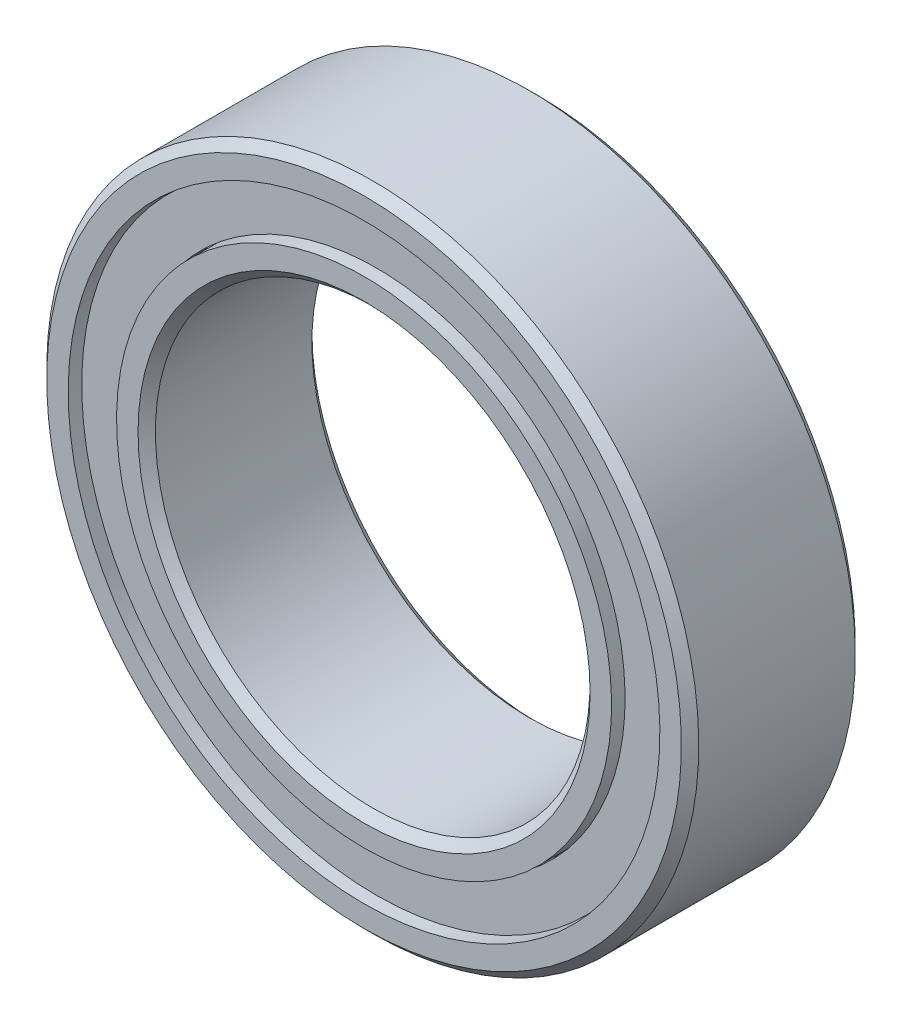
ISO-10303-21;
HEADER;
FILE_DESCRIPTION(('STEP AP214'),'2;1');
FILE_NAME('part.step','',(''),(''),'','','');
FILE_SCHEMA(('AUTOMOTIVE_DESIGN { 1 0 10303 214 1 1 1 1 }'));
ENDSEC;
DATA;
#1=APPLICATION_CONTEXT('core data for automotive mechanical design processes');
#2=APPLICATION_PROTOCOL_DEFINITION('international standard','automotive_design',2000,#1);
#3=PRODUCT_CONTEXT('',#1,'mechanical');
#4=PRODUCT('Part','Part','',(#3));
#5=PRODUCT_RELATED_PRODUCT_CATEGORY('part','',(#4));
#6=PRODUCT_DEFINITION_FORMATION('','',#4);
#7=PRODUCT_DEFINITION_CONTEXT('part definition',#1,'design');
#8=PRODUCT_DEFINITION('design','',#6,#7);
#9=PRODUCT_DEFINITION_SHAPE('','',#8);
#10=(LENGTH_UNIT() NAMED_UNIT(*) SI_UNIT(.MILLI.,.METRE.));
#11=(NAMED_UNIT(*) PLANE_ANGLE_UNIT() SI_UNIT($,.RADIAN.));
#12=(NAMED_UNIT(*) SI_UNIT($,.STERADIAN.) SOLID_ANGLE_UNIT());
#13=UNCERTAINTY_MEASURE_WITH_UNIT(LENGTH_MEASURE(1.E-05),#10,'distance_accuracy_value','');
#14=(GEOMETRIC_REPRESENTATION_CONTEXT(3) GLOBAL_UNCERTAINTY_ASSIGNED_CONTEXT((#13)) GLOBAL_UNIT_ASSIGNED_CONTEXT((#10,
#11,#12)) REPRESENTATION_CONTEXT('',''));
#15=CARTESIAN_POINT('',(0.,0.,0.));
#16=DIRECTION('',(0.,0.,1.));
#17=DIRECTION('',(1.,0.,0.));
#18=AXIS2_PLACEMENT_3D('',#15,#16,#17);
#19=CARTESIAN_POINT('',(3.37900510909742,5.25783458019492,0.));
#20=DIRECTION('',(0.,0.,1.));
#21=DIRECTION('',(0.540640817455587,0.841253532831188,0.));
#22=AXIS2_PLACEMENT_3D('',#19,#20,#21);
#23=SPHERICAL_SURFACE('',#22,1.04822012578407);
#24=CARTESIAN_POINT('',(3.37900510909742,5.25783458019492,1.04822012578406));
#25=VERTEX_POINT('',#24);
#26=VERTEX_LOOP('',#25);
#27=FACE_BOUND('',#26,.T.);
#28=ADVANCED_FACE('F37',(#27),#23,.T.);
#29=CLOSED_SHELL('',(#28));
#30=MANIFOLD_SOLID_BREP('B2',#29);
#31=CARTESIAN_POINT('',(5.68519997096571,2.59634383126185,0.));
#32=DIRECTION('',(0.,0.,1.));
#33=DIRECTION('',(0.909631995354514,0.415415013001897,0.));
#34=AXIS2_PLACEMENT_3D('',#31,#32,#33);
#35=SPHERICAL_SURFACE('',#34,1.04822012578407);
#36=CARTESIAN_POINT('',(5.68519997096571,2.59634383126185,1.04822012578406));
#37=VERTEX_POINT('',#36);
#38=VERTEX_LOOP('',#37);
#39=FACE_BOUND('',#38,.T.);
#40=ADVANCED_FACE('F57',(#39),#35,.T.);
#41=CLOSED_SHELL('',(#40));
#42=MANIFOLD_SOLID_BREP('B6',#41);
#43=CARTESIAN_POINT('',(6.18638401175584,-0.889467739207972,0.));
#44=DIRECTION('',(0.,0.,1.));
#45=DIRECTION('',(0.989821441880934,-0.142314838273276,0.));
#46=AXIS2_PLACEMENT_3D('',#43,#44,#45);
#47=SPHERICAL_SURFACE('',#46,1.04822012578407);
#48=CARTESIAN_POINT('',(6.18638401175584,-0.889467739207972,1.04822012578406));
#49=VERTEX_POINT('',#48);
#50=VERTEX_LOOP('',#49);
#51=FACE_BOUND('',#50,.T.);
#52=ADVANCED_FACE('F77',(#51),#47,.T.);
#53=CLOSED_SHELL('',(#52));
#54=MANIFOLD_SOLID_BREP('B33',#53);
#55=CARTESIAN_POINT('',(4.72343483971415,-4.09287958715799,0.));
#56=DIRECTION('',(0.,0.,1.));
#57=DIRECTION('',(0.755749574354264,-0.654860733945279,0.));
#58=AXIS2_PLACEMENT_3D('',#55,#56,#57);
#59=SPHERICAL_SURFACE('',#58,1.04822012578407);
#60=CARTESIAN_POINT('',(4.72343483971415,-4.09287958715799,1.04822012578406));
#61=VERTEX_POINT('',#60);
#62=VERTEX_LOOP('',#61);
#63=FACE_BOUND('',#62,.T.);
#64=ADVANCED_FACE('F97',(#63),#59,.T.);
#65=CLOSED_SHELL('',(#64));
#66=MANIFOLD_SOLID_BREP('B53',#65);
#67=CARTESIAN_POINT('',(1.76082848025898,-5.99683108509059,0.));
#68=DIRECTION('',(0.,0.,1.));
#69=DIRECTION('',(0.281732556841437,-0.959492973614495,0.));
#70=AXIS2_PLACEMENT_3D('',#67,#68,#69);
#71=SPHERICAL_SURFACE('',#70,1.04822012578407);
#72=CARTESIAN_POINT('',(1.76082848025898,-5.99683108509059,1.04822012578406));
#73=VERTEX_POINT('',#72);
#74=VERTEX_LOOP('',#73);
#75=FACE_BOUND('',#74,.T.);
#76=ADVANCED_FACE('F117',(#75),#71,.T.);
#77=CLOSED_SHELL('',(#76));
#78=MANIFOLD_SOLID_BREP('B73',#77);
#79=CARTESIAN_POINT('',(-1.7608284802589,-5.99683108509062,0.));
#80=DIRECTION('',(0.,0.,1.));
#81=DIRECTION('',(-0.281732556841424,-0.959492973614499,0.));
#82=AXIS2_PLACEMENT_3D('',#79,#80,#81);
#83=SPHERICAL_SURFACE('',#82,1.04822012578407);
#84=CARTESIAN_POINT('',(-1.7608284802589,-5.99683108509062,1.04822012578406));
#85=VERTEX_POINT('',#84);
#86=VERTEX_LOOP('',#85);
#87=FACE_BOUND('',#86,.T.);
#88=ADVANCED_FACE('F137',(#87),#83,.T.);
#89=CLOSED_SHELL('',(#88));
#90=MANIFOLD_SOLID_BREP('B93',#89);
#91=CARTESIAN_POINT('',(-4.72343483971409,-4.09287958715805,0.));
#92=DIRECTION('',(0.,0.,1.));
#93=DIRECTION('',(-0.755749574354255,-0.654860733945289,0.));
#94=AXIS2_PLACEMENT_3D('',#91,#92,#93);
#95=SPHERICAL_SURFACE('',#94,1.04822012578407);
#96=CARTESIAN_POINT('',(-4.72343483971409,-4.09287958715805,1.04822012578406));
#97=VERTEX_POINT('',#96);
#98=VERTEX_LOOP('',#97);
#99=FACE_BOUND('',#98,.T.);
#100=ADVANCED_FACE('F157',(#99),#95,.T.);
#101=CLOSED_SHELL('',(#100));
#102=MANIFOLD_SOLID_BREP('B113',#101);
#103=CARTESIAN_POINT('',(-6.18638401175583,-0.889467739208054,0.));
#104=DIRECTION('',(0.,0.,1.));
#105=DIRECTION('',(-0.989821441880932,-0.142314838273289,0.));
#106=AXIS2_PLACEMENT_3D('',#103,#104,#105);
#107=SPHERICAL_SURFACE('',#106,1.04822012578407);
#108=CARTESIAN_POINT('',(-6.18638401175583,-0.889467739208054,1.04822012578406));
#109=VERTEX_POINT('',#108);
#110=VERTEX_LOOP('',#109);
#111=FACE_BOUND('',#110,.T.);
#112=ADVANCED_FACE('F177',(#111),#107,.T.);
#113=CLOSED_SHELL('',(#112));
#114=MANIFOLD_SOLID_BREP('B133',#113);
#115=CARTESIAN_POINT('',(-5.68519997096575,2.59634383126178,0.));
#116=DIRECTION('',(0.,0.,1.));
#117=DIRECTION('',(-0.90963199535452,0.415415013001884,0.));
#118=AXIS2_PLACEMENT_3D('',#115,#116,#117);
#119=SPHERICAL_SURFACE('',#118,1.04822012578407);
#120=CARTESIAN_POINT('',(-5.68519997096575,2.59634383126178,1.04822012578406));
#121=VERTEX_POINT('',#120);
#122=VERTEX_LOOP('',#121);
#123=FACE_BOUND('',#122,.T.);
#124=ADVANCED_FACE('F197',(#123),#119,.T.);
#125=CLOSED_SHELL('',(#124));
#126=MANIFOLD_SOLID_BREP('B153',#125);
#127=CARTESIAN_POINT('',(-3.37900510909749,5.25783458019488,0.));
#128=DIRECTION('',(0.,0.,1.));
#129=DIRECTION('',(-0.540640817455599,0.841253532831181,0.));
#130=AXIS2_PLACEMENT_3D('',#127,#128,#129);
#131=SPHERICAL_SURFACE('',#130,1.04822012578407);
#132=CARTESIAN_POINT('',(-3.37900510909749,5.25783458019488,1.04822012578406));
#133=VERTEX_POINT('',#132);
#134=VERTEX_LOOP('',#133);
#135=FACE_BOUND('',#134,.T.);
#136=ADVANCED_FACE('F217',(#135),#131,.T.);
#137=CLOSED_SHELL('',(#136));
#138=MANIFOLD_SOLID_BREP('B173',#137);
#139=CARTESIAN_POINT('',(0.,6.25,0.));
#140=DIRECTION('',(0.,0.,1.));
#141=DIRECTION('',(0.,1.,0.));
#142=AXIS2_PLACEMENT_3D('',#139,#140,#141);
#143=SPHERICAL_SURFACE('',#142,1.04822012578407);
#144=CARTESIAN_POINT('',(0.,6.25,1.04822012578406));
#145=VERTEX_POINT('',#144);
#146=VERTEX_LOOP('',#145);
#147=FACE_BOUND('',#146,.T.);
#148=ADVANCED_FACE('F239',(#147),#143,.T.);
#149=CLOSED_SHELL('',(#148));
#150=MANIFOLD_SOLID_BREP('B193',#149);
#151=CARTESIAN_POINT('',(0.,5.69444444444443,2.00000000000003));
#152=DIRECTION('',(0.,0.,-1.));
#153=DIRECTION('',(0.,1.,0.));
#154=AXIS2_PLACEMENT_3D('',#151,#152,#153);
#155=PLANE('',#154);
#156=CARTESIAN_POINT('',(0.,0.,2.00000000000003));
#157=DIRECTION('',(0.,0.,1.));
#158=DIRECTION('',(0.,-1.,0.));
#159=AXIS2_PLACEMENT_3D('',#156,#157,#158);
#160=CIRCLE('',#159,5.19999999999999);
#161=CARTESIAN_POINT('',(0.,-5.19999999999999,2.00000000000003));
#162=VERTEX_POINT('',#161);
#163=EDGE_CURVE('E287',#162,#162,#160,.T.);
#164=ORIENTED_EDGE('',*,*,#163,.F.);
#165=EDGE_LOOP('',(#164));
#166=FACE_BOUND('',#165,.T.);
#167=CARTESIAN_POINT('',(0.,0.,2.00000000000003));
#168=DIRECTION('',(0.,0.,1.));
#169=DIRECTION('',(0.,-1.,0.));
#170=AXIS2_PLACEMENT_3D('',#167,#168,#169);
#171=CIRCLE('',#170,5.69444444444443);
#172=CARTESIAN_POINT('',(0.,-5.69444444444443,2.00000000000003));
#173=VERTEX_POINT('',#172);
#174=EDGE_CURVE('E238',#173,#173,#171,.T.);
#175=ORIENTED_EDGE('',*,*,#174,.T.);
#176=EDGE_LOOP('',(#175));
#177=FACE_BOUND('',#176,.T.);
#178=ADVANCED_FACE('F259',(#166,#177),#155,.F.);
#179=CARTESIAN_POINT('',(0.,0.,2.00000000000002));
#180=DIRECTION('',(0.,0.,1.));
#181=DIRECTION('',(0.,-1.,0.));
#182=AXIS2_PLACEMENT_3D('',#179,#180,#181);
#183=CYLINDRICAL_SURFACE('',#182,5.69444444444443);
#184=ORIENTED_EDGE('',*,*,#174,.F.);
#185=EDGE_LOOP('',(#184));
#186=FACE_BOUND('',#185,.T.);
#187=CARTESIAN_POINT('',(0.,0.,0.888888888888882));
#188=DIRECTION('',(0.,0.,1.));
#189=DIRECTION('',(0.,-1.,0.));
#190=AXIS2_PLACEMENT_3D('',#187,#188,#189);
#191=CIRCLE('',#190,5.69444444444443);
#192=CARTESIAN_POINT('',(0.,-5.69444444444443,0.888888888888882));
#193=VERTEX_POINT('',#192);
#194=EDGE_CURVE('E265',#193,#193,#191,.T.);
#195=ORIENTED_EDGE('',*,*,#194,.T.);
#196=EDGE_LOOP('',(#195));
#197=FACE_BOUND('',#196,.T.);
#198=ADVANCED_FACE('F294',(#186,#197),#183,.T.);
#199=CARTESIAN_POINT('',(0.,0.,0.));
#200=DIRECTION('',(0.,0.,1.));
#201=DIRECTION('',(0.,-1.,0.));
#202=AXIS2_PLACEMENT_3D('',#199,#200,#201);
#203=TOROIDAL_SURFACE('',#202,6.24999999999999,1.04822012578407);
#204=ORIENTED_EDGE('',*,*,#194,.F.);
#205=EDGE_LOOP('',(#204));
#206=FACE_BOUND('',#205,.T.);
#207=CARTESIAN_POINT('',(0.,0.,-0.888888888888884));
#208=DIRECTION('',(0.,0.,1.));
#209=DIRECTION('',(0.,-1.,0.));
#210=AXIS2_PLACEMENT_3D('',#207,#208,#209);
#211=CIRCLE('',#210,5.69444444444443);
#212=CARTESIAN_POINT('',(0.,-5.69444444444443,-0.888888888888885));
#213=VERTEX_POINT('',#212);
#214=EDGE_CURVE('E269',#213,#213,#211,.T.);
#215=ORIENTED_EDGE('',*,*,#214,.T.);
#216=EDGE_LOOP('',(#215));
#217=FACE_BOUND('',#216,.T.);
#218=ADVANCED_FACE('F298',(#206,#217),#203,.F.);
#219=CARTESIAN_POINT('',(0.,0.,2.00000000000002));
#220=DIRECTION('',(0.,0.,1.));
#221=DIRECTION('',(0.,-1.,0.));
#222=AXIS2_PLACEMENT_3D('',#219,#220,#221);
#223=CYLINDRICAL_SURFACE('',#222,5.69444444444443);
#224=ORIENTED_EDGE('',*,*,#214,.F.);
#225=EDGE_LOOP('',(#224));
#226=FACE_BOUND('',#225,.T.);
#227=CARTESIAN_POINT('',(0.,0.,-2.00000000000003));
#228=DIRECTION('',(0.,0.,1.));
#229=DIRECTION('',(0.,-1.,0.));
#230=AXIS2_PLACEMENT_3D('',#227,#228,#229);
#231=CIRCLE('',#230,5.69444444444443);
#232=CARTESIAN_POINT('',(0.,-5.69444444444442,-2.00000000000003));
#233=VERTEX_POINT('',#232);
#234=EDGE_CURVE('E273',#233,#233,#231,.T.);
#235=ORIENTED_EDGE('',*,*,#234,.T.);
#236=EDGE_LOOP('',(#235));
#237=FACE_BOUND('',#236,.T.);
#238=ADVANCED_FACE('F303',(#226,#237),#223,.T.);
#239=CARTESIAN_POINT('',(0.,5.2,-2.00000000000003));
#240=DIRECTION('',(0.,0.,1.));
#241=DIRECTION('',(0.,-1.,0.));
#242=AXIS2_PLACEMENT_3D('',#239,#240,#241);
#243=PLANE('',#242);
#244=ORIENTED_EDGE('',*,*,#234,.F.);
#245=EDGE_LOOP('',(#244));
#246=FACE_BOUND('',#245,.T.);
#247=CARTESIAN_POINT('',(0.,0.,-2.00000000000003));
#248=DIRECTION('',(0.,0.,1.));
#249=DIRECTION('',(0.,-1.,0.));
#250=AXIS2_PLACEMENT_3D('',#247,#248,#249);
#251=CIRCLE('',#250,5.2);
#252=CARTESIAN_POINT('',(0.,-5.2,-2.00000000000004));
#253=VERTEX_POINT('',#252);
#254=EDGE_CURVE('E278',#253,#253,#251,.T.);
#255=ORIENTED_EDGE('',*,*,#254,.T.);
#256=EDGE_LOOP('',(#255));
#257=FACE_BOUND('',#256,.T.);
#258=ADVANCED_FACE('F309',(#246,#257),#243,.F.);
#259=CARTESIAN_POINT('',(0.,0.,-1.80000000000003));
#260=DIRECTION('',(0.,0.,-1.));
#261=DIRECTION('',(0.,1.,0.));
#262=AXIS2_PLACEMENT_3D('',#259,#260,#261);
#263=CONICAL_SURFACE('',#262,4.99999999999999,0.785398163397475);
#264=ORIENTED_EDGE('',*,*,#254,.F.);
#265=EDGE_LOOP('',(#264));
#266=FACE_BOUND('',#265,.T.);
#267=CARTESIAN_POINT('',(0.,0.,-1.80000000000003));
#268=DIRECTION('',(0.,0.,1.));
#269=DIRECTION('',(0.,-1.,0.));
#270=AXIS2_PLACEMENT_3D('',#267,#268,#269);
#271=CIRCLE('',#270,4.99999999999999);
#272=CARTESIAN_POINT('',(0.,-4.99999999999999,-1.80000000000003));
#273=VERTEX_POINT('',#272);
#274=EDGE_CURVE('E281',#273,#273,#271,.T.);
#275=ORIENTED_EDGE('',*,*,#274,.T.);
#276=EDGE_LOOP('',(#275));
#277=FACE_BOUND('',#276,.T.);
#278=ADVANCED_FACE('F313',(#266,#277),#263,.F.);
#279=CARTESIAN_POINT('',(0.,0.,2.00000000000002));
#280=DIRECTION('',(0.,0.,1.));
#281=DIRECTION('',(0.,-1.,0.));
#282=AXIS2_PLACEMENT_3D('',#279,#280,#281);
#283=CYLINDRICAL_SURFACE('',#282,4.99999999999999);
#284=ORIENTED_EDGE('',*,*,#274,.F.);
#285=EDGE_LOOP('',(#284));
#286=FACE_BOUND('',#285,.T.);
#287=CARTESIAN_POINT('',(0.,0.,1.80000000000002));
#288=DIRECTION('',(0.,0.,1.));
#289=DIRECTION('',(0.,-1.,0.));
#290=AXIS2_PLACEMENT_3D('',#287,#288,#289);
#291=CIRCLE('',#290,5.);
#292=CARTESIAN_POINT('',(0.,-5.,1.80000000000001));
#293=VERTEX_POINT('',#292);
#294=EDGE_CURVE('E284',#293,#293,#291,.T.);
#295=ORIENTED_EDGE('',*,*,#294,.T.);
#296=EDGE_LOOP('',(#295));
#297=FACE_BOUND('',#296,.T.);
#298=ADVANCED_FACE('F317',(#286,#297),#283,.F.);
#299=CARTESIAN_POINT('',(0.,0.,2.00000000000003));
#300=DIRECTION('',(0.,0.,1.));
#301=DIRECTION('',(0.,-1.,0.));
#302=AXIS2_PLACEMENT_3D('',#299,#300,#301);
#303=CONICAL_SURFACE('',#302,5.19999999999999,0.785398163397398);
#304=ORIENTED_EDGE('',*,*,#294,.F.);
#305=EDGE_LOOP('',(#304));
#306=FACE_BOUND('',#305,.T.);
#307=ORIENTED_EDGE('',*,*,#163,.T.);
#308=EDGE_LOOP('',(#307));
#309=FACE_BOUND('',#308,.T.);
#310=ADVANCED_FACE('F291',(#306,#309),#303,.F.);
#311=CLOSED_SHELL('',(#178,#198,#218,#238,#258,#278,#298,#310));
#312=MANIFOLD_SOLID_BREP('B213',#311);
#313=CARTESIAN_POINT('',(0.,5.71984444444445,-1.33361006289205));
#314=DIRECTION('',(0.,0.,-1.));
#315=DIRECTION('',(0.,1.,0.));
#316=AXIS2_PLACEMENT_3D('',#313,#314,#315);
#317=PLANE('',#316);
#318=CARTESIAN_POINT('',(0.,0.,-1.33361006289205));
#319=DIRECTION('',(0.,0.,1.));
#320=DIRECTION('',(0.,-1.,0.));
#321=AXIS2_PLACEMENT_3D('',#318,#319,#320);
#322=CIRCLE('',#321,5.71984444444445);
#323=CARTESIAN_POINT('',(0.,-5.71984444444445,-1.33361006289205));
#324=VERTEX_POINT('',#323);
#325=EDGE_CURVE('E402',#324,#324,#322,.T.);
#326=ORIENTED_EDGE('',*,*,#325,.F.);
#327=EDGE_LOOP('',(#326));
#328=FACE_BOUND('',#327,.T.);
#329=CARTESIAN_POINT('',(0.,0.,-1.33361006289205));
#330=DIRECTION('',(0.,0.,1.));
#331=DIRECTION('',(0.,-1.,0.));
#332=AXIS2_PLACEMENT_3D('',#329,#330,#331);
#333=CIRCLE('',#332,6.78015555555556);
#334=CARTESIAN_POINT('',(0.,-6.78015555555556,-1.33361006289205));
#335=VERTEX_POINT('',#334);
#336=EDGE_CURVE('E258',#335,#335,#333,.T.);
#337=ORIENTED_EDGE('',*,*,#336,.T.);
#338=EDGE_LOOP('',(#337));
#339=FACE_BOUND('',#338,.T.);
#340=ADVANCED_FACE('F388',(#328,#339),#317,.F.);
#341=CARTESIAN_POINT('',(0.,0.,2.00000000000002));
#342=DIRECTION('',(0.,0.,1.));
#343=DIRECTION('',(0.,-1.,0.));
#344=AXIS2_PLACEMENT_3D('',#341,#342,#343);
#345=CYLINDRICAL_SURFACE('',#344,6.78015555555556);
#346=ORIENTED_EDGE('',*,*,#336,.F.);
#347=EDGE_LOOP('',(#346));
#348=FACE_BOUND('',#347,.T.);
#349=CARTESIAN_POINT('',(0.,0.,-1.71461006289205));
#350=DIRECTION('',(0.,0.,1.));
#351=DIRECTION('',(0.,-1.,0.));
#352=AXIS2_PLACEMENT_3D('',#349,#350,#351);
#353=CIRCLE('',#352,6.78015555555556);
#354=CARTESIAN_POINT('',(0.,-6.78015555555555,-1.71461006289205));
#355=VERTEX_POINT('',#354);
#356=EDGE_CURVE('E394',#355,#355,#353,.T.);
#357=ORIENTED_EDGE('',*,*,#356,.T.);
#358=EDGE_LOOP('',(#357));
#359=FACE_BOUND('',#358,.T.);
#360=ADVANCED_FACE('F411',(#348,#359),#345,.T.);
#361=CARTESIAN_POINT('',(0.,5.71984444444445,-1.71461006289205));
#362=DIRECTION('',(0.,0.,1.));
#363=DIRECTION('',(0.,-1.,0.));
#364=AXIS2_PLACEMENT_3D('',#361,#362,#363);
#365=PLANE('',#364);
#366=ORIENTED_EDGE('',*,*,#356,.F.);
#367=EDGE_LOOP('',(#366));
#368=FACE_BOUND('',#367,.T.);
#369=CARTESIAN_POINT('',(0.,0.,-1.71461006289205));
#370=DIRECTION('',(0.,0.,1.));
#371=DIRECTION('',(0.,-1.,0.));
#372=AXIS2_PLACEMENT_3D('',#369,#370,#371);
#373=CIRCLE('',#372,5.71984444444445);
#374=CARTESIAN_POINT('',(0.,-5.71984444444445,-1.71461006289205));
#375=VERTEX_POINT('',#374);
#376=EDGE_CURVE('E398',#375,#375,#373,.T.);
#377=ORIENTED_EDGE('',*,*,#376,.T.);
#378=EDGE_LOOP('',(#377));
#379=FACE_BOUND('',#378,.T.);
#380=ADVANCED_FACE('F415',(#368,#379),#365,.F.);
#381=CARTESIAN_POINT('',(0.,0.,2.00000000000002));
#382=DIRECTION('',(0.,0.,1.));
#383=DIRECTION('',(0.,-1.,0.));
#384=AXIS2_PLACEMENT_3D('',#381,#382,#383);
#385=CYLINDRICAL_SURFACE('',#384,5.71984444444445);
#386=ORIENTED_EDGE('',*,*,#376,.F.);
#387=EDGE_LOOP('',(#386));
#388=FACE_BOUND('',#387,.T.);
#389=ORIENTED_EDGE('',*,*,#325,.T.);
#390=EDGE_LOOP('',(#389));
#391=FACE_BOUND('',#390,.T.);
#392=ADVANCED_FACE('F408',(#388,#391),#385,.F.);
#393=CLOSED_SHELL('',(#340,#360,#380,#392));
#394=MANIFOLD_SOLID_BREP('B233',#393);
#395=CARTESIAN_POINT('',(0.,5.71984444444445,1.71461006289204));
#396=DIRECTION('',(0.,0.,-1.));
#397=DIRECTION('',(0.,1.,0.));
#398=AXIS2_PLACEMENT_3D('',#395,#396,#397);
#399=PLANE('',#398);
#400=CARTESIAN_POINT('',(0.,0.,1.71461006289204));
#401=DIRECTION('',(0.,0.,1.));
#402=DIRECTION('',(0.,-1.,0.));
#403=AXIS2_PLACEMENT_3D('',#400,#401,#402);
#404=CIRCLE('',#403,5.71984444444445);
#405=CARTESIAN_POINT('',(0.,-5.71984444444445,1.71461006289204));
#406=VERTEX_POINT('',#405);
#407=EDGE_CURVE('E387',#406,#406,#404,.T.);
#408=ORIENTED_EDGE('',*,*,#407,.F.);
#409=EDGE_LOOP('',(#408));
#410=FACE_BOUND('',#409,.T.);
#411=CARTESIAN_POINT('',(0.,0.,1.71461006289204));
#412=DIRECTION('',(0.,0.,1.));
#413=DIRECTION('',(0.,-1.,0.));
#414=AXIS2_PLACEMENT_3D('',#411,#412,#413);
#415=CIRCLE('',#414,6.78015555555556);
#416=CARTESIAN_POINT('',(0.,-6.78015555555556,1.71461006289204));
#417=VERTEX_POINT('',#416);
#418=EDGE_CURVE('E470',#417,#417,#415,.T.);
#419=ORIENTED_EDGE('',*,*,#418,.T.);
#420=EDGE_LOOP('',(#419));
#421=FACE_BOUND('',#420,.T.);
#422=ADVANCED_FACE('F456',(#410,#421),#399,.F.);
#423=CARTESIAN_POINT('',(0.,0.,2.00000000000002));
#424=DIRECTION('',(0.,0.,1.));
#425=DIRECTION('',(0.,-1.,0.));
#426=AXIS2_PLACEMENT_3D('',#423,#424,#425);
#427=CYLINDRICAL_SURFACE('',#426,5.71984444444445);
#428=CARTESIAN_POINT('',(0.,0.,1.33361006289204));
#429=DIRECTION('',(0.,0.,1.));
#430=DIRECTION('',(0.,-1.,0.));
#431=AXIS2_PLACEMENT_3D('',#428,#429,#430);
#432=CIRCLE('',#431,5.71984444444445);
#433=CARTESIAN_POINT('',(0.,-5.71984444444445,1.33361006289204));
#434=VERTEX_POINT('',#433);
#435=EDGE_CURVE('E462',#434,#434,#432,.T.);
#436=ORIENTED_EDGE('',*,*,#435,.F.);
#437=EDGE_LOOP('',(#436));
#438=FACE_BOUND('',#437,.T.);
#439=ORIENTED_EDGE('',*,*,#407,.T.);
#440=EDGE_LOOP('',(#439));
#441=FACE_BOUND('',#440,.T.);
#442=ADVANCED_FACE('F485',(#438,#441),#427,.F.);
#443=CARTESIAN_POINT('',(0.,5.71984444444445,1.33361006289204));
#444=DIRECTION('',(0.,0.,1.));
#445=DIRECTION('',(0.,-1.,0.));
#446=AXIS2_PLACEMENT_3D('',#443,#444,#445);
#447=PLANE('',#446);
#448=CARTESIAN_POINT('',(0.,0.,1.33361006289204));
#449=DIRECTION('',(0.,0.,1.));
#450=DIRECTION('',(0.,-1.,0.));
#451=AXIS2_PLACEMENT_3D('',#448,#449,#450);
#452=CIRCLE('',#451,6.78015555555556);
#453=CARTESIAN_POINT('',(0.,-6.78015555555556,1.33361006289204));
#454=VERTEX_POINT('',#453);
#455=EDGE_CURVE('E466',#454,#454,#452,.T.);
#456=ORIENTED_EDGE('',*,*,#455,.F.);
#457=EDGE_LOOP('',(#456));
#458=FACE_BOUND('',#457,.T.);
#459=ORIENTED_EDGE('',*,*,#435,.T.);
#460=EDGE_LOOP('',(#459));
#461=FACE_BOUND('',#460,.T.);
#462=ADVANCED_FACE('F480',(#458,#461),#447,.F.);
#463=CARTESIAN_POINT('',(0.,0.,2.00000000000002));
#464=DIRECTION('',(0.,0.,1.));
#465=DIRECTION('',(0.,-1.,0.));
#466=AXIS2_PLACEMENT_3D('',#463,#464,#465);
#467=CYLINDRICAL_SURFACE('',#466,6.78015555555556);
#468=ORIENTED_EDGE('',*,*,#418,.F.);
#469=EDGE_LOOP('',(#468));
#470=FACE_BOUND('',#469,.T.);
#471=ORIENTED_EDGE('',*,*,#455,.T.);
#472=EDGE_LOOP('',(#471));
#473=FACE_BOUND('',#472,.T.);
#474=ADVANCED_FACE('F477',(#470,#473),#467,.T.);
#475=CLOSED_SHELL('',(#422,#442,#462,#474));
#476=MANIFOLD_SOLID_BREP('B253',#475);
#477=CARTESIAN_POINT('',(0.,0.,1.80000000000002));
#478=DIRECTION('',(0.,0.,-1.));
#479=DIRECTION('',(0.,1.,0.));
#480=AXIS2_PLACEMENT_3D('',#477,#478,#479);
#481=CONICAL_SURFACE('',#480,7.49999999999999,0.785398163397463);
#482=CARTESIAN_POINT('',(0.,0.,2.00000000000002));
#483=DIRECTION('',(0.,0.,1.));
#484=DIRECTION('',(0.,-1.,0.));
#485=AXIS2_PLACEMENT_3D('',#482,#483,#484);
#486=CIRCLE('',#485,7.29999999999999);
#487=CARTESIAN_POINT('',(0.,-7.29999999999999,2.00000000000002));
#488=VERTEX_POINT('',#487);
#489=EDGE_CURVE('E545',#488,#488,#486,.T.);
#490=ORIENTED_EDGE('',*,*,#489,.F.);
#491=EDGE_LOOP('',(#490));
#492=FACE_BOUND('',#491,.T.);
#493=CARTESIAN_POINT('',(0.,0.,1.80000000000002));
#494=DIRECTION('',(0.,0.,1.));
#495=DIRECTION('',(0.,-1.,0.));
#496=AXIS2_PLACEMENT_3D('',#493,#494,#495);
#497=CIRCLE('',#496,7.49999999999999);
#498=CARTESIAN_POINT('',(0.,-7.49999999999999,1.80000000000002));
#499=VERTEX_POINT('',#498);
#500=EDGE_CURVE('E455',#499,#499,#497,.T.);
#501=ORIENTED_EDGE('',*,*,#500,.T.);
#502=EDGE_LOOP('',(#501));
#503=FACE_BOUND('',#502,.T.);
#504=ADVANCED_FACE('F517',(#492,#503),#481,.T.);
#505=CARTESIAN_POINT('',(0.,0.,2.00000000000002));
#506=DIRECTION('',(0.,0.,1.));
#507=DIRECTION('',(0.,-1.,0.));
#508=AXIS2_PLACEMENT_3D('',#505,#506,#507);
#509=CYLINDRICAL_SURFACE('',#508,7.49999999999999);
#510=ORIENTED_EDGE('',*,*,#500,.F.);
#511=EDGE_LOOP('',(#510));
#512=FACE_BOUND('',#511,.T.);
#513=CARTESIAN_POINT('',(0.,0.,-1.80000000000003));
#514=DIRECTION('',(0.,0.,1.));
#515=DIRECTION('',(0.,-1.,0.));
#516=AXIS2_PLACEMENT_3D('',#513,#514,#515);
#517=CIRCLE('',#516,7.49999999999999);
#518=CARTESIAN_POINT('',(0.,-7.49999999999999,-1.80000000000003));
#519=VERTEX_POINT('',#518);
#520=EDGE_CURVE('E523',#519,#519,#517,.T.);
#521=ORIENTED_EDGE('',*,*,#520,.T.);
#522=EDGE_LOOP('',(#521));
#523=FACE_BOUND('',#522,.T.);
#524=ADVANCED_FACE('F552',(#512,#523),#509,.T.);
#525=CARTESIAN_POINT('',(0.,0.,-2.00000000000003));
#526=DIRECTION('',(0.,0.,1.));
#527=DIRECTION('',(0.,-1.,0.));
#528=AXIS2_PLACEMENT_3D('',#525,#526,#527);
#529=CONICAL_SURFACE('',#528,7.29999999999999,0.785398163397463);
#530=ORIENTED_EDGE('',*,*,#520,.F.);
#531=EDGE_LOOP('',(#530));
#532=FACE_BOUND('',#531,.T.);
#533=CARTESIAN_POINT('',(0.,0.,-2.00000000000003));
#534=DIRECTION('',(0.,0.,1.));
#535=DIRECTION('',(0.,-1.,0.));
#536=AXIS2_PLACEMENT_3D('',#533,#534,#535);
#537=CIRCLE('',#536,7.29999999999999);
#538=CARTESIAN_POINT('',(0.,-7.29999999999999,-2.00000000000003));
#539=VERTEX_POINT('',#538);
#540=EDGE_CURVE('E527',#539,#539,#537,.T.);
#541=ORIENTED_EDGE('',*,*,#540,.T.);
#542=EDGE_LOOP('',(#541));
#543=FACE_BOUND('',#542,.T.);
#544=ADVANCED_FACE('F556',(#532,#543),#529,.T.);
#545=CARTESIAN_POINT('',(0.,7.29999999999999,-2.00000000000003));
#546=DIRECTION('',(0.,0.,1.));
#547=DIRECTION('',(0.,-1.,0.));
#548=AXIS2_PLACEMENT_3D('',#545,#546,#547);
#549=PLANE('',#548);
#550=ORIENTED_EDGE('',*,*,#540,.F.);
#551=EDGE_LOOP('',(#550));
#552=FACE_BOUND('',#551,.T.);
#553=CARTESIAN_POINT('',(0.,0.,-2.00000000000003));
#554=DIRECTION('',(0.,0.,1.));
#555=DIRECTION('',(0.,-1.,0.));
#556=AXIS2_PLACEMENT_3D('',#553,#554,#555);
#557=CIRCLE('',#556,6.80555555555555);
#558=CARTESIAN_POINT('',(0.,-6.80555555555555,-2.00000000000003));
#559=VERTEX_POINT('',#558);
#560=EDGE_CURVE('E531',#559,#559,#557,.T.);
#561=ORIENTED_EDGE('',*,*,#560,.T.);
#562=EDGE_LOOP('',(#561));
#563=FACE_BOUND('',#562,.T.);
#564=ADVANCED_FACE('F561',(#552,#563),#549,.F.);
#565=CARTESIAN_POINT('',(0.,0.,2.00000000000002));
#566=DIRECTION('',(0.,0.,1.));
#567=DIRECTION('',(0.,-1.,0.));
#568=AXIS2_PLACEMENT_3D('',#565,#566,#567);
#569=CYLINDRICAL_SURFACE('',#568,6.80555555555555);
#570=ORIENTED_EDGE('',*,*,#560,.F.);
#571=EDGE_LOOP('',(#570));
#572=FACE_BOUND('',#571,.T.);
#573=CARTESIAN_POINT('',(0.,0.,-0.888888888888897));
#574=DIRECTION('',(0.,0.,1.));
#575=DIRECTION('',(0.,-1.,0.));
#576=AXIS2_PLACEMENT_3D('',#573,#574,#575);
#577=CIRCLE('',#576,6.80555555555555);
#578=CARTESIAN_POINT('',(0.,-6.80555555555555,-0.888888888888897));
#579=VERTEX_POINT('',#578);
#580=EDGE_CURVE('E536',#579,#579,#577,.T.);
#581=ORIENTED_EDGE('',*,*,#580,.T.);
#582=EDGE_LOOP('',(#581));
#583=FACE_BOUND('',#582,.T.);
#584=ADVANCED_FACE('F567',(#572,#583),#569,.F.);
#585=CARTESIAN_POINT('',(0.,0.,0.));
#586=DIRECTION('',(0.,0.,1.));
#587=DIRECTION('',(0.,-1.,0.));
#588=AXIS2_PLACEMENT_3D('',#585,#586,#587);
#589=TOROIDAL_SURFACE('',#588,6.25,1.04822012578407);
#590=ORIENTED_EDGE('',*,*,#580,.F.);
#591=EDGE_LOOP('',(#590));
#592=FACE_BOUND('',#591,.T.);
#593=CARTESIAN_POINT('',(0.,0.,0.888888888888883));
#594=DIRECTION('',(0.,0.,1.));
#595=DIRECTION('',(0.,-1.,0.));
#596=AXIS2_PLACEMENT_3D('',#593,#594,#595);
#597=CIRCLE('',#596,6.80555555555555);
#598=CARTESIAN_POINT('',(0.,-6.80555555555555,0.888888888888882));
#599=VERTEX_POINT('',#598);
#600=EDGE_CURVE('E539',#599,#599,#597,.T.);
#601=ORIENTED_EDGE('',*,*,#600,.T.);
#602=EDGE_LOOP('',(#601));
#603=FACE_BOUND('',#602,.T.);
#604=ADVANCED_FACE('F571',(#592,#603),#589,.F.);
#605=CARTESIAN_POINT('',(0.,0.,2.00000000000002));
#606=DIRECTION('',(0.,0.,1.));
#607=DIRECTION('',(0.,-1.,0.));
#608=AXIS2_PLACEMENT_3D('',#605,#606,#607);
#609=CYLINDRICAL_SURFACE('',#608,6.80555555555555);
#610=ORIENTED_EDGE('',*,*,#600,.F.);
#611=EDGE_LOOP('',(#610));
#612=FACE_BOUND('',#611,.T.);
#613=CARTESIAN_POINT('',(0.,0.,2.00000000000001));
#614=DIRECTION('',(0.,0.,1.));
#615=DIRECTION('',(0.,-1.,0.));
#616=AXIS2_PLACEMENT_3D('',#613,#614,#615);
#617=CIRCLE('',#616,6.80555555555555);
#618=CARTESIAN_POINT('',(0.,-6.80555555555555,2.00000000000001));
#619=VERTEX_POINT('',#618);
#620=EDGE_CURVE('E542',#619,#619,#617,.T.);
#621=ORIENTED_EDGE('',*,*,#620,.T.);
#622=EDGE_LOOP('',(#621));
#623=FACE_BOUND('',#622,.T.);
#624=ADVANCED_FACE('F575',(#612,#623),#609,.F.);
#625=CARTESIAN_POINT('',(0.,7.29999999999999,2.00000000000002));
#626=DIRECTION('',(0.,0.,-1.));
#627=DIRECTION('',(0.,1.,0.));
#628=AXIS2_PLACEMENT_3D('',#625,#626,#627);
#629=PLANE('',#628);
#630=ORIENTED_EDGE('',*,*,#620,.F.);
#631=EDGE_LOOP('',(#630));
#632=FACE_BOUND('',#631,.T.);
#633=ORIENTED_EDGE('',*,*,#489,.T.);
#634=EDGE_LOOP('',(#633));
#635=FACE_BOUND('',#634,.T.);
#636=ADVANCED_FACE('F549',(#632,#635),#629,.F.);
#637=CLOSED_SHELL('',(#504,#524,#544,#564,#584,#604,#624,#636));
#638=MANIFOLD_SOLID_BREP('B382',#637);
#639=ADVANCED_BREP_SHAPE_REPRESENTATION('',(#18,#30,#42,#54,#66,#78,#90,#102,#114,#126,#138,
#150,#312,#394,#476,#638),#14);
#640=SHAPE_DEFINITION_REPRESENTATION(#9,#639);
ENDSEC;
END-ISO-10303-21;
